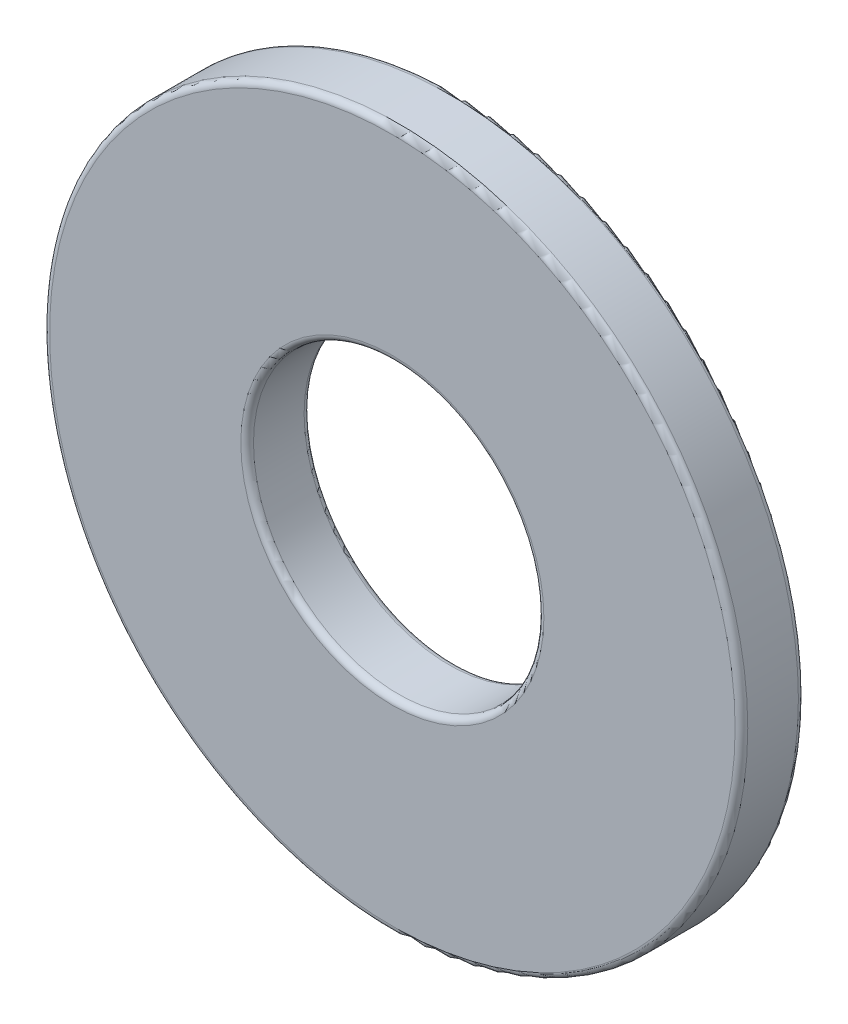
ISO-10303-21;
HEADER;
FILE_DESCRIPTION(('STEP AP214'),'2;1');
FILE_NAME('part.step','',(''),(''),'','','');
FILE_SCHEMA(('AUTOMOTIVE_DESIGN { 1 0 10303 214 1 1 1 1 }'));
ENDSEC;
DATA;
#1=APPLICATION_CONTEXT('core data for automotive mechanical design processes');
#2=APPLICATION_PROTOCOL_DEFINITION('international standard','automotive_design',2000,#1);
#3=PRODUCT_CONTEXT('',#1,'mechanical');
#4=PRODUCT('Part','Part','',(#3));
#5=PRODUCT_RELATED_PRODUCT_CATEGORY('part','',(#4));
#6=PRODUCT_DEFINITION_FORMATION('','',#4);
#7=PRODUCT_DEFINITION_CONTEXT('part definition',#1,'design');
#8=PRODUCT_DEFINITION('design','',#6,#7);
#9=PRODUCT_DEFINITION_SHAPE('','',#8);
#10=(LENGTH_UNIT() NAMED_UNIT(*) SI_UNIT(.MILLI.,.METRE.));
#11=(NAMED_UNIT(*) PLANE_ANGLE_UNIT() SI_UNIT($,.RADIAN.));
#12=(NAMED_UNIT(*) SI_UNIT($,.STERADIAN.) SOLID_ANGLE_UNIT());
#13=UNCERTAINTY_MEASURE_WITH_UNIT(LENGTH_MEASURE(1.E-05),#10,'distance_accuracy_value','');
#14=(GEOMETRIC_REPRESENTATION_CONTEXT(3) GLOBAL_UNCERTAINTY_ASSIGNED_CONTEXT((#13)) GLOBAL_UNIT_ASSIGNED_CONTEXT((#10,
#11,#12)) REPRESENTATION_CONTEXT('',''));
#15=CARTESIAN_POINT('',(0.,0.,0.));
#16=DIRECTION('',(0.,0.,1.));
#17=DIRECTION('',(1.,0.,0.));
#18=AXIS2_PLACEMENT_3D('',#15,#16,#17);
#19=CARTESIAN_POINT('',(0.,0.,-0.8636));
#20=DIRECTION('',(0.,0.,1.));
#21=DIRECTION('',(1.,0.,0.));
#22=AXIS2_PLACEMENT_3D('',#19,#20,#21);
#23=CYLINDRICAL_SURFACE('',#22,9.525);
#24=CARTESIAN_POINT('',(0.,0.,-0.69088));
#25=DIRECTION('',(0.,0.,1.));
#26=DIRECTION('',(1.,0.,0.));
#27=AXIS2_PLACEMENT_3D('',#24,#25,#26);
#28=CIRCLE('',#27,9.525);
#29=CARTESIAN_POINT('',(9.525,0.,-0.69088));
#30=VERTEX_POINT('',#29);
#31=EDGE_CURVE('E58',#30,#30,#28,.T.);
#32=ORIENTED_EDGE('',*,*,#31,.T.);
#33=EDGE_LOOP('',(#32));
#34=FACE_BOUND('',#33,.T.);
#35=CARTESIAN_POINT('',(0.,0.,0.69088));
#36=DIRECTION('',(0.,0.,1.));
#37=DIRECTION('',(1.,0.,0.));
#38=AXIS2_PLACEMENT_3D('',#35,#36,#37);
#39=CIRCLE('',#38,9.525);
#40=CARTESIAN_POINT('',(9.525,0.,0.69088));
#41=VERTEX_POINT('',#40);
#42=EDGE_CURVE('E61',#41,#41,#39,.F.);
#43=ORIENTED_EDGE('',*,*,#42,.T.);
#44=EDGE_LOOP('',(#43));
#45=FACE_BOUND('',#44,.T.);
#46=ADVANCED_FACE('F32',(#34,#45),#23,.T.);
#47=CARTESIAN_POINT('',(0.,0.,-0.8636));
#48=DIRECTION('',(0.,0.,1.));
#49=DIRECTION('',(1.,0.,0.));
#50=AXIS2_PLACEMENT_3D('',#47,#48,#49);
#51=PLANE('',#50);
#52=CARTESIAN_POINT('',(0.,0.,-0.8636));
#53=DIRECTION('',(0.,0.,1.));
#54=DIRECTION('',(1.,0.,0.));
#55=AXIS2_PLACEMENT_3D('',#52,#53,#54);
#56=CIRCLE('',#55,9.35228);
#57=CARTESIAN_POINT('',(9.35228,0.,-0.8636));
#58=VERTEX_POINT('',#57);
#59=EDGE_CURVE('E52',#58,#58,#56,.F.);
#60=ORIENTED_EDGE('',*,*,#59,.T.);
#61=EDGE_LOOP('',(#60));
#62=FACE_BOUND('',#61,.T.);
#63=CARTESIAN_POINT('',(0.,0.,-0.8636));
#64=DIRECTION('',(0.,0.,1.));
#65=DIRECTION('',(1.,0.,0.));
#66=AXIS2_PLACEMENT_3D('',#63,#64,#65);
#67=CIRCLE('',#66,4.13512);
#68=CARTESIAN_POINT('',(4.13512,0.,-0.8636));
#69=VERTEX_POINT('',#68);
#70=EDGE_CURVE('E55',#69,#69,#67,.T.);
#71=ORIENTED_EDGE('',*,*,#70,.T.);
#72=EDGE_LOOP('',(#71));
#73=FACE_BOUND('',#72,.T.);
#74=ADVANCED_FACE('F75',(#62,#73),#51,.F.);
#75=CARTESIAN_POINT('',(0.,0.,-0.8636));
#76=DIRECTION('',(0.,0.,1.));
#77=DIRECTION('',(1.,0.,0.));
#78=AXIS2_PLACEMENT_3D('',#75,#76,#77);
#79=CYLINDRICAL_SURFACE('',#78,3.9624);
#80=CARTESIAN_POINT('',(0.,0.,-0.69088));
#81=DIRECTION('',(0.,0.,1.));
#82=DIRECTION('',(1.,0.,0.));
#83=AXIS2_PLACEMENT_3D('',#80,#81,#82);
#84=CIRCLE('',#83,3.9624);
#85=CARTESIAN_POINT('',(3.9624,0.,-0.69088));
#86=VERTEX_POINT('',#85);
#87=EDGE_CURVE('E43',#86,#86,#84,.F.);
#88=ORIENTED_EDGE('',*,*,#87,.T.);
#89=EDGE_LOOP('',(#88));
#90=FACE_BOUND('',#89,.T.);
#91=CARTESIAN_POINT('',(0.,0.,0.69088));
#92=DIRECTION('',(0.,0.,1.));
#93=DIRECTION('',(1.,0.,0.));
#94=AXIS2_PLACEMENT_3D('',#91,#92,#93);
#95=CIRCLE('',#94,3.9624);
#96=CARTESIAN_POINT('',(3.9624,0.,0.69088));
#97=VERTEX_POINT('',#96);
#98=EDGE_CURVE('E47',#97,#97,#95,.T.);
#99=ORIENTED_EDGE('',*,*,#98,.T.);
#100=EDGE_LOOP('',(#99));
#101=FACE_BOUND('',#100,.T.);
#102=ADVANCED_FACE('F81',(#90,#101),#79,.F.);
#103=CARTESIAN_POINT('',(0.,0.,0.8636));
#104=DIRECTION('',(0.,0.,1.));
#105=DIRECTION('',(1.,0.,0.));
#106=AXIS2_PLACEMENT_3D('',#103,#104,#105);
#107=PLANE('',#106);
#108=CARTESIAN_POINT('',(0.,0.,0.8636));
#109=DIRECTION('',(0.,0.,1.));
#110=DIRECTION('',(1.,0.,0.));
#111=AXIS2_PLACEMENT_3D('',#108,#109,#110);
#112=CIRCLE('',#111,4.13512);
#113=CARTESIAN_POINT('',(4.13512,0.,0.8636));
#114=VERTEX_POINT('',#113);
#115=EDGE_CURVE('E10',#114,#114,#112,.F.);
#116=ORIENTED_EDGE('',*,*,#115,.T.);
#117=EDGE_LOOP('',(#116));
#118=FACE_BOUND('',#117,.T.);
#119=CARTESIAN_POINT('',(0.,0.,0.8636));
#120=DIRECTION('',(0.,0.,1.));
#121=DIRECTION('',(1.,0.,0.));
#122=AXIS2_PLACEMENT_3D('',#119,#120,#121);
#123=CIRCLE('',#122,9.35228);
#124=CARTESIAN_POINT('',(9.35228,0.,0.8636));
#125=VERTEX_POINT('',#124);
#126=EDGE_CURVE('E39',#125,#125,#123,.T.);
#127=ORIENTED_EDGE('',*,*,#126,.T.);
#128=EDGE_LOOP('',(#127));
#129=FACE_BOUND('',#128,.T.);
#130=ADVANCED_FACE('F89',(#118,#129),#107,.T.);
#131=CARTESIAN_POINT('',(0.,0.,-0.69088));
#132=DIRECTION('',(0.,0.,1.));
#133=DIRECTION('',(1.,0.,0.));
#134=AXIS2_PLACEMENT_3D('',#131,#132,#133);
#135=TOROIDAL_SURFACE('',#134,9.35228,0.17272);
#136=ORIENTED_EDGE('',*,*,#59,.F.);
#137=EDGE_LOOP('',(#136));
#138=FACE_BOUND('',#137,.T.);
#139=ORIENTED_EDGE('',*,*,#31,.F.);
#140=EDGE_LOOP('',(#139));
#141=FACE_BOUND('',#140,.T.);
#142=ADVANCED_FACE('F86',(#138,#141),#135,.T.);
#143=CARTESIAN_POINT('',(0.,0.,-0.69088));
#144=DIRECTION('',(0.,0.,1.));
#145=DIRECTION('',(1.,0.,0.));
#146=AXIS2_PLACEMENT_3D('',#143,#144,#145);
#147=TOROIDAL_SURFACE('',#146,4.13512,0.17272);
#148=ORIENTED_EDGE('',*,*,#87,.F.);
#149=EDGE_LOOP('',(#148));
#150=FACE_BOUND('',#149,.T.);
#151=ORIENTED_EDGE('',*,*,#70,.F.);
#152=EDGE_LOOP('',(#151));
#153=FACE_BOUND('',#152,.T.);
#154=ADVANCED_FACE('F72',(#150,#153),#147,.T.);
#155=CARTESIAN_POINT('',(0.,0.,0.69088));
#156=DIRECTION('',(0.,0.,1.));
#157=DIRECTION('',(1.,0.,0.));
#158=AXIS2_PLACEMENT_3D('',#155,#156,#157);
#159=TOROIDAL_SURFACE('',#158,4.13512,0.17272);
#160=ORIENTED_EDGE('',*,*,#115,.F.);
#161=EDGE_LOOP('',(#160));
#162=FACE_BOUND('',#161,.T.);
#163=ORIENTED_EDGE('',*,*,#98,.F.);
#164=EDGE_LOOP('',(#163));
#165=FACE_BOUND('',#164,.T.);
#166=ADVANCED_FACE('F68',(#162,#165),#159,.T.);
#167=CARTESIAN_POINT('',(0.,0.,0.69088));
#168=DIRECTION('',(0.,0.,1.));
#169=DIRECTION('',(1.,0.,0.));
#170=AXIS2_PLACEMENT_3D('',#167,#168,#169);
#171=TOROIDAL_SURFACE('',#170,9.35228,0.17272);
#172=ORIENTED_EDGE('',*,*,#42,.F.);
#173=EDGE_LOOP('',(#172));
#174=FACE_BOUND('',#173,.T.);
#175=ORIENTED_EDGE('',*,*,#126,.F.);
#176=EDGE_LOOP('',(#175));
#177=FACE_BOUND('',#176,.T.);
#178=ADVANCED_FACE('F34',(#174,#177),#171,.T.);
#179=CLOSED_SHELL('',(#46,#74,#102,#130,#142,#154,#166,#178));
#180=MANIFOLD_SOLID_BREP('B2',#179);
#181=ADVANCED_BREP_SHAPE_REPRESENTATION('',(#18,#180),#14);
#182=SHAPE_DEFINITION_REPRESENTATION(#9,#181);
ENDSEC;
END-ISO-10303-21;
